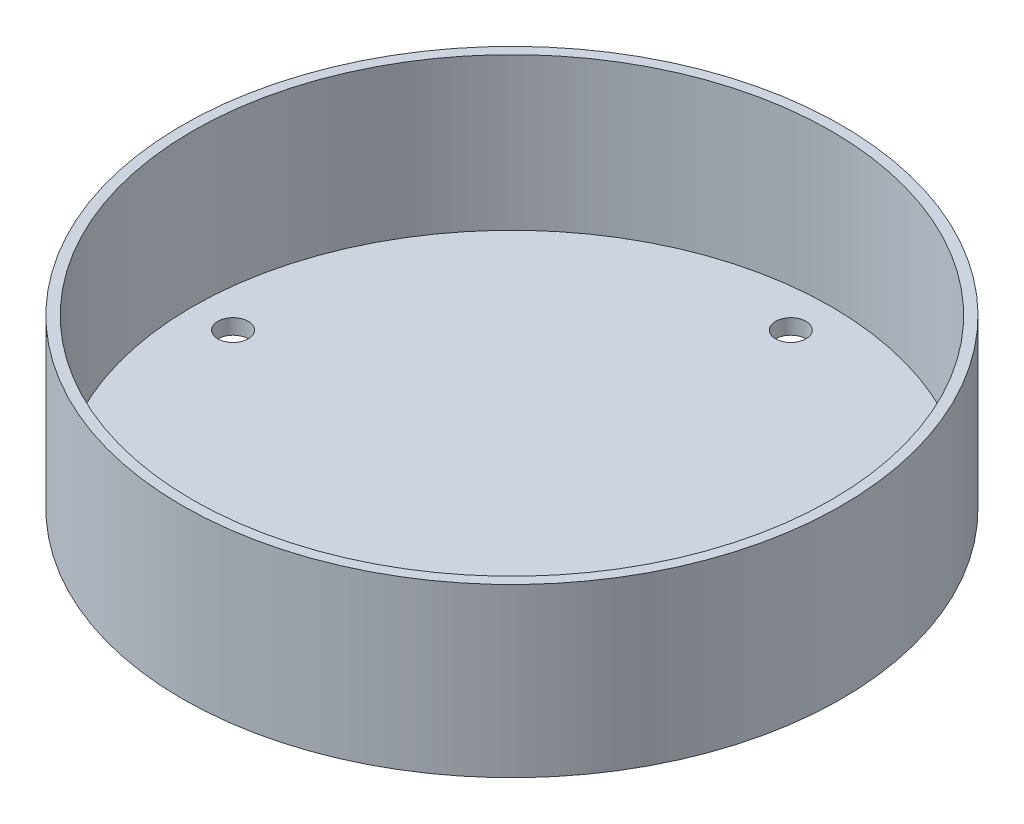
ISO-10303-21;
HEADER;
FILE_DESCRIPTION(('STEP AP214'),'2;1');
FILE_NAME('part.step','',(''),(''),'','','');
FILE_SCHEMA(('AUTOMOTIVE_DESIGN { 1 0 10303 214 1 1 1 1 }'));
ENDSEC;
DATA;
#1=APPLICATION_CONTEXT('core data for automotive mechanical design processes');
#2=APPLICATION_PROTOCOL_DEFINITION('international standard','automotive_design',2000,#1);
#3=PRODUCT_CONTEXT('',#1,'mechanical');
#4=PRODUCT('Part','Part','',(#3));
#5=PRODUCT_RELATED_PRODUCT_CATEGORY('part','',(#4));
#6=PRODUCT_DEFINITION_FORMATION('','',#4);
#7=PRODUCT_DEFINITION_CONTEXT('part definition',#1,'design');
#8=PRODUCT_DEFINITION('design','',#6,#7);
#9=PRODUCT_DEFINITION_SHAPE('','',#8);
#10=(LENGTH_UNIT() NAMED_UNIT(*) SI_UNIT(.MILLI.,.METRE.));
#11=(NAMED_UNIT(*) PLANE_ANGLE_UNIT() SI_UNIT($,.RADIAN.));
#12=(NAMED_UNIT(*) SI_UNIT($,.STERADIAN.) SOLID_ANGLE_UNIT());
#13=UNCERTAINTY_MEASURE_WITH_UNIT(LENGTH_MEASURE(1.E-05),#10,'distance_accuracy_value','');
#14=(GEOMETRIC_REPRESENTATION_CONTEXT(3) GLOBAL_UNCERTAINTY_ASSIGNED_CONTEXT((#13)) GLOBAL_UNIT_ASSIGNED_CONTEXT((#10,
#11,#12)) REPRESENTATION_CONTEXT('',''));
#15=CARTESIAN_POINT('',(0.,0.,0.));
#16=DIRECTION('',(0.,0.,1.));
#17=DIRECTION('',(1.,0.,0.));
#18=AXIS2_PLACEMENT_3D('',#15,#16,#17);
#19=CARTESIAN_POINT('',(0.,3.,0.));
#20=DIRECTION('',(0.,1.,0.));
#21=DIRECTION('',(0.,0.,1.));
#22=AXIS2_PLACEMENT_3D('',#19,#20,#21);
#23=PLANE('',#22);
#24=CARTESIAN_POINT('',(0.,3.,-55.));
#25=DIRECTION('',(0.,1.,0.));
#26=DIRECTION('',(0.,0.,1.));
#27=AXIS2_PLACEMENT_3D('',#24,#25,#26);
#28=CIRCLE('',#27,3.);
#29=CARTESIAN_POINT('',(0.,3.,-52.));
#30=VERTEX_POINT('',#29);
#31=EDGE_CURVE('E48',#30,#30,#28,.T.);
#32=ORIENTED_EDGE('',*,*,#31,.F.);
#33=EDGE_LOOP('',(#32));
#34=FACE_BOUND('',#33,.T.);
#35=CARTESIAN_POINT('',(55.,3.,-5.76094420909117E-13));
#36=DIRECTION('',(0.,1.,0.));
#37=DIRECTION('',(-1.,0.,0.));
#38=AXIS2_PLACEMENT_3D('',#35,#36,#37);
#39=CIRCLE('',#38,3.);
#40=CARTESIAN_POINT('',(52.,3.,-5.44671088859529E-13));
#41=VERTEX_POINT('',#40);
#42=EDGE_CURVE('E54',#41,#41,#39,.T.);
#43=ORIENTED_EDGE('',*,*,#42,.F.);
#44=EDGE_LOOP('',(#43));
#45=FACE_BOUND('',#44,.T.);
#46=CARTESIAN_POINT('',(0.,3.,55.));
#47=DIRECTION('',(0.,1.,0.));
#48=DIRECTION('',(0.,0.,-1.));
#49=AXIS2_PLACEMENT_3D('',#46,#47,#48);
#50=CIRCLE('',#49,3.);
#51=CARTESIAN_POINT('',(0.,3.,52.));
#52=VERTEX_POINT('',#51);
#53=EDGE_CURVE('E62',#52,#52,#50,.T.);
#54=ORIENTED_EDGE('',*,*,#53,.F.);
#55=EDGE_LOOP('',(#54));
#56=FACE_BOUND('',#55,.T.);
#57=CARTESIAN_POINT('',(-55.,3.,1.92031473636372E-13));
#58=DIRECTION('',(0.,1.,0.));
#59=DIRECTION('',(1.,0.,0.));
#60=AXIS2_PLACEMENT_3D('',#57,#58,#59);
#61=CIRCLE('',#60,3.);
#62=CARTESIAN_POINT('',(-52.,3.,1.81557029619843E-13));
#63=VERTEX_POINT('',#62);
#64=EDGE_CURVE('E52',#63,#63,#61,.T.);
#65=ORIENTED_EDGE('',*,*,#64,.F.);
#66=EDGE_LOOP('',(#65));
#67=FACE_BOUND('',#66,.T.);
#68=CARTESIAN_POINT('',(0.,3.,0.));
#69=DIRECTION('',(0.,1.,0.));
#70=DIRECTION('',(0.,0.,1.));
#71=AXIS2_PLACEMENT_3D('',#68,#69,#70);
#72=CIRCLE('',#71,63.);
#73=CARTESIAN_POINT('',(0.,3.,63.));
#74=VERTEX_POINT('',#73);
#75=EDGE_CURVE('E10',#74,#74,#72,.F.);
#76=ORIENTED_EDGE('',*,*,#75,.F.);
#77=EDGE_LOOP('',(#76));
#78=FACE_BOUND('',#77,.T.);
#79=ADVANCED_FACE('F33',(#34,#45,#56,#67,#78),#23,.T.);
#80=CARTESIAN_POINT('',(0.,3.,0.));
#81=DIRECTION('',(0.,-1.,0.));
#82=DIRECTION('',(0.,0.,-1.));
#83=AXIS2_PLACEMENT_3D('',#80,#81,#82);
#84=CYLINDRICAL_SURFACE('',#83,65.);
#85=CARTESIAN_POINT('',(0.,0.,0.));
#86=DIRECTION('',(0.,1.,0.));
#87=DIRECTION('',(0.,0.,1.));
#88=AXIS2_PLACEMENT_3D('',#85,#86,#87);
#89=CIRCLE('',#88,65.);
#90=CARTESIAN_POINT('',(0.,0.,65.));
#91=VERTEX_POINT('',#90);
#92=EDGE_CURVE('E40',#91,#91,#89,.T.);
#93=ORIENTED_EDGE('',*,*,#92,.T.);
#94=EDGE_LOOP('',(#93));
#95=FACE_BOUND('',#94,.T.);
#96=CARTESIAN_POINT('',(0.,33.,0.));
#97=DIRECTION('',(0.,1.,0.));
#98=DIRECTION('',(0.,0.,1.));
#99=AXIS2_PLACEMENT_3D('',#96,#97,#98);
#100=CIRCLE('',#99,65.);
#101=CARTESIAN_POINT('',(0.,33.,65.));
#102=VERTEX_POINT('',#101);
#103=EDGE_CURVE('E61',#102,#102,#100,.T.);
#104=ORIENTED_EDGE('',*,*,#103,.F.);
#105=EDGE_LOOP('',(#104));
#106=FACE_BOUND('',#105,.T.);
#107=ADVANCED_FACE('F35',(#95,#106),#84,.T.);
#108=CARTESIAN_POINT('',(0.,0.,0.));
#109=DIRECTION('',(0.,1.,0.));
#110=DIRECTION('',(0.,0.,1.));
#111=AXIS2_PLACEMENT_3D('',#108,#109,#110);
#112=PLANE('',#111);
#113=CARTESIAN_POINT('',(-55.,0.,1.92031473636372E-13));
#114=DIRECTION('',(0.,1.,0.));
#115=DIRECTION('',(1.,0.,0.));
#116=AXIS2_PLACEMENT_3D('',#113,#114,#115);
#117=CIRCLE('',#116,3.);
#118=CARTESIAN_POINT('',(-52.,0.,1.81557029619843E-13));
#119=VERTEX_POINT('',#118);
#120=EDGE_CURVE('E65',#119,#119,#117,.T.);
#121=ORIENTED_EDGE('',*,*,#120,.T.);
#122=EDGE_LOOP('',(#121));
#123=FACE_BOUND('',#122,.T.);
#124=CARTESIAN_POINT('',(0.,0.,55.));
#125=DIRECTION('',(0.,1.,0.));
#126=DIRECTION('',(0.,0.,-1.));
#127=AXIS2_PLACEMENT_3D('',#124,#125,#126);
#128=CIRCLE('',#127,3.);
#129=CARTESIAN_POINT('',(0.,0.,52.));
#130=VERTEX_POINT('',#129);
#131=EDGE_CURVE('E57',#130,#130,#128,.T.);
#132=ORIENTED_EDGE('',*,*,#131,.T.);
#133=EDGE_LOOP('',(#132));
#134=FACE_BOUND('',#133,.T.);
#135=CARTESIAN_POINT('',(55.,0.,-5.76094420909117E-13));
#136=DIRECTION('',(0.,1.,0.));
#137=DIRECTION('',(-1.,0.,0.));
#138=AXIS2_PLACEMENT_3D('',#135,#136,#137);
#139=CIRCLE('',#138,3.);
#140=CARTESIAN_POINT('',(52.,0.,-5.44671088859529E-13));
#141=VERTEX_POINT('',#140);
#142=EDGE_CURVE('E58',#141,#141,#139,.T.);
#143=ORIENTED_EDGE('',*,*,#142,.T.);
#144=EDGE_LOOP('',(#143));
#145=FACE_BOUND('',#144,.T.);
#146=CARTESIAN_POINT('',(0.,0.,-55.));
#147=DIRECTION('',(0.,1.,0.));
#148=DIRECTION('',(0.,0.,1.));
#149=AXIS2_PLACEMENT_3D('',#146,#147,#148);
#150=CIRCLE('',#149,3.);
#151=CARTESIAN_POINT('',(0.,0.,-52.));
#152=VERTEX_POINT('',#151);
#153=EDGE_CURVE('E44',#152,#152,#150,.T.);
#154=ORIENTED_EDGE('',*,*,#153,.T.);
#155=EDGE_LOOP('',(#154));
#156=FACE_BOUND('',#155,.T.);
#157=ORIENTED_EDGE('',*,*,#92,.F.);
#158=EDGE_LOOP('',(#157));
#159=FACE_BOUND('',#158,.T.);
#160=ADVANCED_FACE('F99',(#123,#134,#145,#156,#159),#112,.F.);
#161=CARTESIAN_POINT('',(0.,0.,-55.));
#162=DIRECTION('',(0.,1.,0.));
#163=DIRECTION('',(0.,0.,1.));
#164=AXIS2_PLACEMENT_3D('',#161,#162,#163);
#165=CYLINDRICAL_SURFACE('',#164,3.);
#166=ORIENTED_EDGE('',*,*,#153,.F.);
#167=EDGE_LOOP('',(#166));
#168=FACE_BOUND('',#167,.T.);
#169=ORIENTED_EDGE('',*,*,#31,.T.);
#170=EDGE_LOOP('',(#169));
#171=FACE_BOUND('',#170,.T.);
#172=ADVANCED_FACE('F103',(#168,#171),#165,.F.);
#173=CARTESIAN_POINT('',(55.,0.,-5.76094420909117E-13));
#174=DIRECTION('',(0.,1.,0.));
#175=DIRECTION('',(-1.,0.,0.));
#176=AXIS2_PLACEMENT_3D('',#173,#174,#175);
#177=CYLINDRICAL_SURFACE('',#176,3.);
#178=ORIENTED_EDGE('',*,*,#142,.F.);
#179=EDGE_LOOP('',(#178));
#180=FACE_BOUND('',#179,.T.);
#181=ORIENTED_EDGE('',*,*,#42,.T.);
#182=EDGE_LOOP('',(#181));
#183=FACE_BOUND('',#182,.T.);
#184=ADVANCED_FACE('F110',(#180,#183),#177,.F.);
#185=CARTESIAN_POINT('',(0.,0.,55.));
#186=DIRECTION('',(0.,1.,0.));
#187=DIRECTION('',(0.,0.,-1.));
#188=AXIS2_PLACEMENT_3D('',#185,#186,#187);
#189=CYLINDRICAL_SURFACE('',#188,3.);
#190=ORIENTED_EDGE('',*,*,#131,.F.);
#191=EDGE_LOOP('',(#190));
#192=FACE_BOUND('',#191,.T.);
#193=ORIENTED_EDGE('',*,*,#53,.T.);
#194=EDGE_LOOP('',(#193));
#195=FACE_BOUND('',#194,.T.);
#196=ADVANCED_FACE('F90',(#192,#195),#189,.F.);
#197=CARTESIAN_POINT('',(-55.,0.,1.92031473636372E-13));
#198=DIRECTION('',(0.,1.,0.));
#199=DIRECTION('',(1.,0.,0.));
#200=AXIS2_PLACEMENT_3D('',#197,#198,#199);
#201=CYLINDRICAL_SURFACE('',#200,3.);
#202=ORIENTED_EDGE('',*,*,#120,.F.);
#203=EDGE_LOOP('',(#202));
#204=FACE_BOUND('',#203,.T.);
#205=ORIENTED_EDGE('',*,*,#64,.T.);
#206=EDGE_LOOP('',(#205));
#207=FACE_BOUND('',#206,.T.);
#208=ADVANCED_FACE('F82',(#204,#207),#201,.F.);
#209=CARTESIAN_POINT('',(0.,33.,0.));
#210=DIRECTION('',(0.,1.,0.));
#211=DIRECTION('',(0.,0.,1.));
#212=AXIS2_PLACEMENT_3D('',#209,#210,#211);
#213=PLANE('',#212);
#214=ORIENTED_EDGE('',*,*,#103,.T.);
#215=EDGE_LOOP('',(#214));
#216=FACE_BOUND('',#215,.T.);
#217=CARTESIAN_POINT('',(0.,33.,0.));
#218=DIRECTION('',(0.,1.,0.));
#219=DIRECTION('',(0.,0.,1.));
#220=AXIS2_PLACEMENT_3D('',#217,#218,#219);
#221=CIRCLE('',#220,63.);
#222=CARTESIAN_POINT('',(0.,33.,63.));
#223=VERTEX_POINT('',#222);
#224=EDGE_CURVE('E74',#223,#223,#221,.T.);
#225=ORIENTED_EDGE('',*,*,#224,.F.);
#226=EDGE_LOOP('',(#225));
#227=FACE_BOUND('',#226,.T.);
#228=ADVANCED_FACE('F80',(#216,#227),#213,.T.);
#229=CARTESIAN_POINT('',(0.,33.,0.));
#230=DIRECTION('',(0.,-1.,0.));
#231=DIRECTION('',(0.,0.,-1.));
#232=AXIS2_PLACEMENT_3D('',#229,#230,#231);
#233=CYLINDRICAL_SURFACE('',#232,63.);
#234=ORIENTED_EDGE('',*,*,#224,.T.);
#235=EDGE_LOOP('',(#234));
#236=FACE_BOUND('',#235,.T.);
#237=ORIENTED_EDGE('',*,*,#75,.T.);
#238=EDGE_LOOP('',(#237));
#239=FACE_BOUND('',#238,.T.);
#240=ADVANCED_FACE('F78',(#236,#239),#233,.F.);
#241=CLOSED_SHELL('',(#79,#107,#160,#172,#184,#196,#208,#228,#240));
#242=MANIFOLD_SOLID_BREP('B2',#241);
#243=ADVANCED_BREP_SHAPE_REPRESENTATION('',(#18,#242),#14);
#244=SHAPE_DEFINITION_REPRESENTATION(#9,#243);
ENDSEC;
END-ISO-10303-21;
